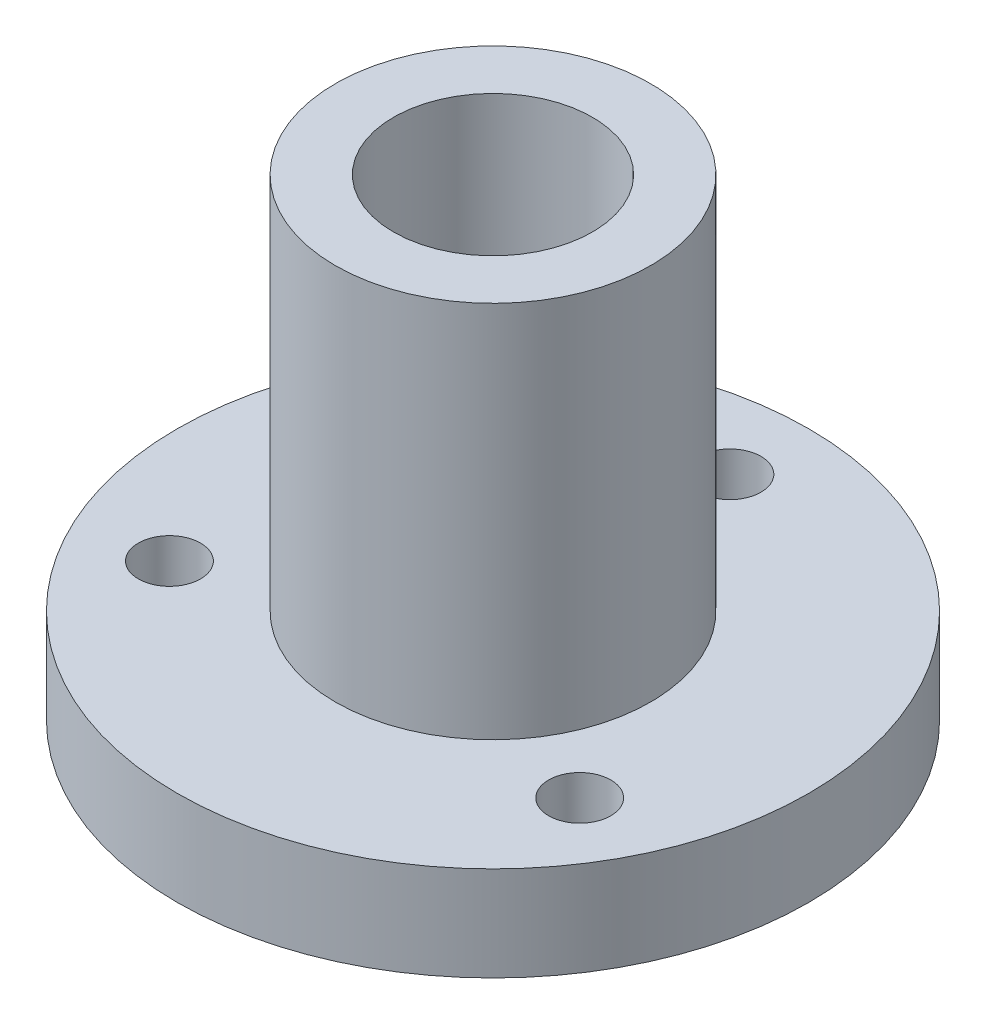
ISO-10303-21;
HEADER;
FILE_DESCRIPTION(('STEP AP214'),'2;1');
FILE_NAME('part.step','',(''),(''),'','','');
FILE_SCHEMA(('AUTOMOTIVE_DESIGN { 1 0 10303 214 1 1 1 1 }'));
ENDSEC;
DATA;
#1=APPLICATION_CONTEXT('core data for automotive mechanical design processes');
#2=APPLICATION_PROTOCOL_DEFINITION('international standard','automotive_design',2000,#1);
#3=PRODUCT_CONTEXT('',#1,'mechanical');
#4=PRODUCT('Part','Part','',(#3));
#5=PRODUCT_RELATED_PRODUCT_CATEGORY('part','',(#4));
#6=PRODUCT_DEFINITION_FORMATION('','',#4);
#7=PRODUCT_DEFINITION_CONTEXT('part definition',#1,'design');
#8=PRODUCT_DEFINITION('design','',#6,#7);
#9=PRODUCT_DEFINITION_SHAPE('','',#8);
#10=(LENGTH_UNIT() NAMED_UNIT(*) SI_UNIT(.MILLI.,.METRE.));
#11=(NAMED_UNIT(*) PLANE_ANGLE_UNIT() SI_UNIT($,.RADIAN.));
#12=(NAMED_UNIT(*) SI_UNIT($,.STERADIAN.) SOLID_ANGLE_UNIT());
#13=UNCERTAINTY_MEASURE_WITH_UNIT(LENGTH_MEASURE(1.E-05),#10,'distance_accuracy_value','');
#14=(GEOMETRIC_REPRESENTATION_CONTEXT(3) GLOBAL_UNCERTAINTY_ASSIGNED_CONTEXT((#13)) GLOBAL_UNIT_ASSIGNED_CONTEXT((#10,
#11,#12)) REPRESENTATION_CONTEXT('',''));
#15=CARTESIAN_POINT('',(0.,0.,0.));
#16=DIRECTION('',(0.,0.,1.));
#17=DIRECTION('',(1.,0.,0.));
#18=AXIS2_PLACEMENT_3D('',#15,#16,#17);
#19=CARTESIAN_POINT('',(0.,3.8,0.));
#20=DIRECTION('',(0.,1.,0.));
#21=DIRECTION('',(0.,0.,1.));
#22=AXIS2_PLACEMENT_3D('',#19,#20,#21);
#23=PLANE('',#22);
#24=CARTESIAN_POINT('',(-8.24999999999999,3.8,4.76313972081442));
#25=DIRECTION('',(0.,1.,0.));
#26=DIRECTION('',(0.,0.,1.));
#27=AXIS2_PLACEMENT_3D('',#24,#25,#26);
#28=CIRCLE('',#27,1.25);
#29=CARTESIAN_POINT('',(-8.24999999999999,3.8,6.01313972081442));
#30=VERTEX_POINT('',#29);
#31=EDGE_CURVE('E80',#30,#30,#28,.T.);
#32=ORIENTED_EDGE('',*,*,#31,.F.);
#33=EDGE_LOOP('',(#32));
#34=FACE_BOUND('',#33,.T.);
#35=CARTESIAN_POINT('',(8.25000000000001,3.8,4.76313972081442));
#36=DIRECTION('',(0.,1.,0.));
#37=DIRECTION('',(0.,0.,1.));
#38=AXIS2_PLACEMENT_3D('',#35,#36,#37);
#39=CIRCLE('',#38,1.25);
#40=CARTESIAN_POINT('',(8.25000000000001,3.8,6.01313972081442));
#41=VERTEX_POINT('',#40);
#42=EDGE_CURVE('E72',#41,#41,#39,.T.);
#43=ORIENTED_EDGE('',*,*,#42,.F.);
#44=EDGE_LOOP('',(#43));
#45=FACE_BOUND('',#44,.T.);
#46=CARTESIAN_POINT('',(0.,3.8,-9.52627944162882));
#47=DIRECTION('',(0.,1.,0.));
#48=DIRECTION('',(0.,0.,1.));
#49=AXIS2_PLACEMENT_3D('',#46,#47,#48);
#50=CIRCLE('',#49,1.25);
#51=CARTESIAN_POINT('',(0.,3.8,-8.27627944162882));
#52=VERTEX_POINT('',#51);
#53=EDGE_CURVE('E59',#52,#52,#50,.T.);
#54=ORIENTED_EDGE('',*,*,#53,.F.);
#55=EDGE_LOOP('',(#54));
#56=FACE_BOUND('',#55,.T.);
#57=CARTESIAN_POINT('',(0.,3.8,0.));
#58=DIRECTION('',(0.,1.,0.));
#59=DIRECTION('',(0.,0.,1.));
#60=AXIS2_PLACEMENT_3D('',#57,#58,#59);
#61=CIRCLE('',#60,12.7);
#62=CARTESIAN_POINT('',(0.,3.8,12.7));
#63=VERTEX_POINT('',#62);
#64=EDGE_CURVE('E11',#63,#63,#61,.T.);
#65=ORIENTED_EDGE('',*,*,#64,.T.);
#66=EDGE_LOOP('',(#65));
#67=FACE_BOUND('',#66,.T.);
#68=CARTESIAN_POINT('',(0.,3.8,0.));
#69=DIRECTION('',(0.,1.,0.));
#70=DIRECTION('',(0.,0.,1.));
#71=AXIS2_PLACEMENT_3D('',#68,#69,#70);
#72=CIRCLE('',#71,6.34);
#73=CARTESIAN_POINT('',(0.,3.8,6.34));
#74=VERTEX_POINT('',#73);
#75=EDGE_CURVE('E58',#74,#74,#72,.T.);
#76=ORIENTED_EDGE('',*,*,#75,.F.);
#77=EDGE_LOOP('',(#76));
#78=FACE_BOUND('',#77,.T.);
#79=ADVANCED_FACE('F34',(#34,#45,#56,#67,#78),#23,.T.);
#80=CARTESIAN_POINT('',(0.,0.,0.));
#81=DIRECTION('',(0.,1.,0.));
#82=DIRECTION('',(0.,0.,1.));
#83=AXIS2_PLACEMENT_3D('',#80,#81,#82);
#84=PLANE('',#83);
#85=CARTESIAN_POINT('',(-8.24999999999999,0.,4.76313972081442));
#86=DIRECTION('',(0.,-1.,0.));
#87=DIRECTION('',(0.,0.,-1.));
#88=AXIS2_PLACEMENT_3D('',#85,#86,#87);
#89=CIRCLE('',#88,1.25);
#90=CARTESIAN_POINT('',(-8.24999999999999,0.,3.51313972081442));
#91=VERTEX_POINT('',#90);
#92=EDGE_CURVE('E84',#91,#91,#89,.T.);
#93=ORIENTED_EDGE('',*,*,#92,.F.);
#94=EDGE_LOOP('',(#93));
#95=FACE_BOUND('',#94,.T.);
#96=CARTESIAN_POINT('',(8.25000000000001,0.,4.76313972081442));
#97=DIRECTION('',(0.,-1.,0.));
#98=DIRECTION('',(0.,0.,-1.));
#99=AXIS2_PLACEMENT_3D('',#96,#97,#98);
#100=CIRCLE('',#99,1.25);
#101=CARTESIAN_POINT('',(8.25000000000001,0.,3.51313972081442));
#102=VERTEX_POINT('',#101);
#103=EDGE_CURVE('E76',#102,#102,#100,.T.);
#104=ORIENTED_EDGE('',*,*,#103,.F.);
#105=EDGE_LOOP('',(#104));
#106=FACE_BOUND('',#105,.T.);
#107=CARTESIAN_POINT('',(0.,0.,-9.52627944162882));
#108=DIRECTION('',(0.,-1.,0.));
#109=DIRECTION('',(0.,0.,-1.));
#110=AXIS2_PLACEMENT_3D('',#107,#108,#109);
#111=CIRCLE('',#110,1.25);
#112=CARTESIAN_POINT('',(0.,0.,-10.7762794416288));
#113=VERTEX_POINT('',#112);
#114=EDGE_CURVE('E68',#113,#113,#111,.T.);
#115=ORIENTED_EDGE('',*,*,#114,.F.);
#116=EDGE_LOOP('',(#115));
#117=FACE_BOUND('',#116,.T.);
#118=CARTESIAN_POINT('',(0.,0.,0.));
#119=DIRECTION('',(0.,1.,0.));
#120=DIRECTION('',(0.,0.,1.));
#121=AXIS2_PLACEMENT_3D('',#118,#119,#120);
#122=CIRCLE('',#121,12.7);
#123=CARTESIAN_POINT('',(0.,0.,12.7));
#124=VERTEX_POINT('',#123);
#125=EDGE_CURVE('E38',#124,#124,#122,.T.);
#126=ORIENTED_EDGE('',*,*,#125,.F.);
#127=EDGE_LOOP('',(#126));
#128=FACE_BOUND('',#127,.T.);
#129=CARTESIAN_POINT('',(0.,0.,0.));
#130=DIRECTION('',(0.,1.,0.));
#131=DIRECTION('',(0.,0.,1.));
#132=AXIS2_PLACEMENT_3D('',#129,#130,#131);
#133=CIRCLE('',#132,4.);
#134=CARTESIAN_POINT('',(0.,0.,4.));
#135=VERTEX_POINT('',#134);
#136=EDGE_CURVE('E50',#135,#135,#133,.T.);
#137=ORIENTED_EDGE('',*,*,#136,.T.);
#138=EDGE_LOOP('',(#137));
#139=FACE_BOUND('',#138,.T.);
#140=ADVANCED_FACE('F91',(#95,#106,#117,#128,#139),#84,.F.);
#141=CARTESIAN_POINT('',(0.,3.8,0.));
#142=DIRECTION('',(0.,-1.,0.));
#143=DIRECTION('',(0.,0.,-1.));
#144=AXIS2_PLACEMENT_3D('',#141,#142,#143);
#145=CYLINDRICAL_SURFACE('',#144,12.7);
#146=ORIENTED_EDGE('',*,*,#64,.F.);
#147=EDGE_LOOP('',(#146));
#148=FACE_BOUND('',#147,.T.);
#149=ORIENTED_EDGE('',*,*,#125,.T.);
#150=EDGE_LOOP('',(#149));
#151=FACE_BOUND('',#150,.T.);
#152=ADVANCED_FACE('F36',(#148,#151),#145,.T.);
#153=CARTESIAN_POINT('',(0.,3.8,0.));
#154=DIRECTION('',(0.,-1.,0.));
#155=DIRECTION('',(0.,0.,-1.));
#156=AXIS2_PLACEMENT_3D('',#153,#154,#155);
#157=CYLINDRICAL_SURFACE('',#156,4.);
#158=ORIENTED_EDGE('',*,*,#136,.F.);
#159=EDGE_LOOP('',(#158));
#160=FACE_BOUND('',#159,.T.);
#161=CARTESIAN_POINT('',(0.,19.,0.));
#162=DIRECTION('',(0.,1.,0.));
#163=DIRECTION('',(0.,0.,1.));
#164=AXIS2_PLACEMENT_3D('',#161,#162,#163);
#165=CIRCLE('',#164,4.);
#166=CARTESIAN_POINT('',(0.,19.,4.));
#167=VERTEX_POINT('',#166);
#168=EDGE_CURVE('E55',#167,#167,#165,.T.);
#169=ORIENTED_EDGE('',*,*,#168,.T.);
#170=EDGE_LOOP('',(#169));
#171=FACE_BOUND('',#170,.T.);
#172=ADVANCED_FACE('F102',(#160,#171),#157,.F.);
#173=CARTESIAN_POINT('',(0.,55.9322279708908,0.));
#174=DIRECTION('',(0.,-1.,0.));
#175=DIRECTION('',(0.,0.,-1.));
#176=AXIS2_PLACEMENT_3D('',#173,#174,#175);
#177=CYLINDRICAL_SURFACE('',#176,6.34);
#178=ORIENTED_EDGE('',*,*,#75,.T.);
#179=EDGE_LOOP('',(#178));
#180=FACE_BOUND('',#179,.T.);
#181=CARTESIAN_POINT('',(0.,19.,0.));
#182=DIRECTION('',(0.,1.,0.));
#183=DIRECTION('',(0.,0.,1.));
#184=AXIS2_PLACEMENT_3D('',#181,#182,#183);
#185=CIRCLE('',#184,6.34);
#186=CARTESIAN_POINT('',(0.,19.,6.34));
#187=VERTEX_POINT('',#186);
#188=EDGE_CURVE('E54',#187,#187,#185,.T.);
#189=ORIENTED_EDGE('',*,*,#188,.F.);
#190=EDGE_LOOP('',(#189));
#191=FACE_BOUND('',#190,.T.);
#192=ADVANCED_FACE('F105',(#180,#191),#177,.T.);
#193=CARTESIAN_POINT('',(0.,19.,0.));
#194=DIRECTION('',(0.,1.,0.));
#195=DIRECTION('',(0.,0.,1.));
#196=AXIS2_PLACEMENT_3D('',#193,#194,#195);
#197=PLANE('',#196);
#198=ORIENTED_EDGE('',*,*,#168,.F.);
#199=EDGE_LOOP('',(#198));
#200=FACE_BOUND('',#199,.T.);
#201=ORIENTED_EDGE('',*,*,#188,.T.);
#202=EDGE_LOOP('',(#201));
#203=FACE_BOUND('',#202,.T.);
#204=ADVANCED_FACE('F109',(#200,#203),#197,.T.);
#205=CARTESIAN_POINT('',(0.,0.,-9.52627944162882));
#206=DIRECTION('',(0.,-1.,0.));
#207=DIRECTION('',(0.,0.,-1.));
#208=AXIS2_PLACEMENT_3D('',#205,#206,#207);
#209=CYLINDRICAL_SURFACE('',#208,1.25);
#210=ORIENTED_EDGE('',*,*,#114,.T.);
#211=EDGE_LOOP('',(#210));
#212=FACE_BOUND('',#211,.T.);
#213=ORIENTED_EDGE('',*,*,#53,.T.);
#214=EDGE_LOOP('',(#213));
#215=FACE_BOUND('',#214,.T.);
#216=ADVANCED_FACE('F112',(#212,#215),#209,.F.);
#217=CARTESIAN_POINT('',(8.25000000000001,0.,4.76313972081442));
#218=DIRECTION('',(0.,-1.,0.));
#219=DIRECTION('',(0.,0.,-1.));
#220=AXIS2_PLACEMENT_3D('',#217,#218,#219);
#221=CYLINDRICAL_SURFACE('',#220,1.25);
#222=ORIENTED_EDGE('',*,*,#103,.T.);
#223=EDGE_LOOP('',(#222));
#224=FACE_BOUND('',#223,.T.);
#225=ORIENTED_EDGE('',*,*,#42,.T.);
#226=EDGE_LOOP('',(#225));
#227=FACE_BOUND('',#226,.T.);
#228=ADVANCED_FACE('F134',(#224,#227),#221,.F.);
#229=CARTESIAN_POINT('',(-8.24999999999999,0.,4.76313972081442));
#230=DIRECTION('',(0.,-1.,0.));
#231=DIRECTION('',(0.,0.,-1.));
#232=AXIS2_PLACEMENT_3D('',#229,#230,#231);
#233=CYLINDRICAL_SURFACE('',#232,1.25);
#234=ORIENTED_EDGE('',*,*,#92,.T.);
#235=EDGE_LOOP('',(#234));
#236=FACE_BOUND('',#235,.T.);
#237=ORIENTED_EDGE('',*,*,#31,.T.);
#238=EDGE_LOOP('',(#237));
#239=FACE_BOUND('',#238,.T.);
#240=ADVANCED_FACE('F88',(#236,#239),#233,.F.);
#241=CLOSED_SHELL('',(#79,#140,#152,#172,#192,#204,#216,#228,#240));
#242=MANIFOLD_SOLID_BREP('B2',#241);
#243=ADVANCED_BREP_SHAPE_REPRESENTATION('',(#18,#242),#14);
#244=SHAPE_DEFINITION_REPRESENTATION(#9,#243);
ENDSEC;
END-ISO-10303-21;
